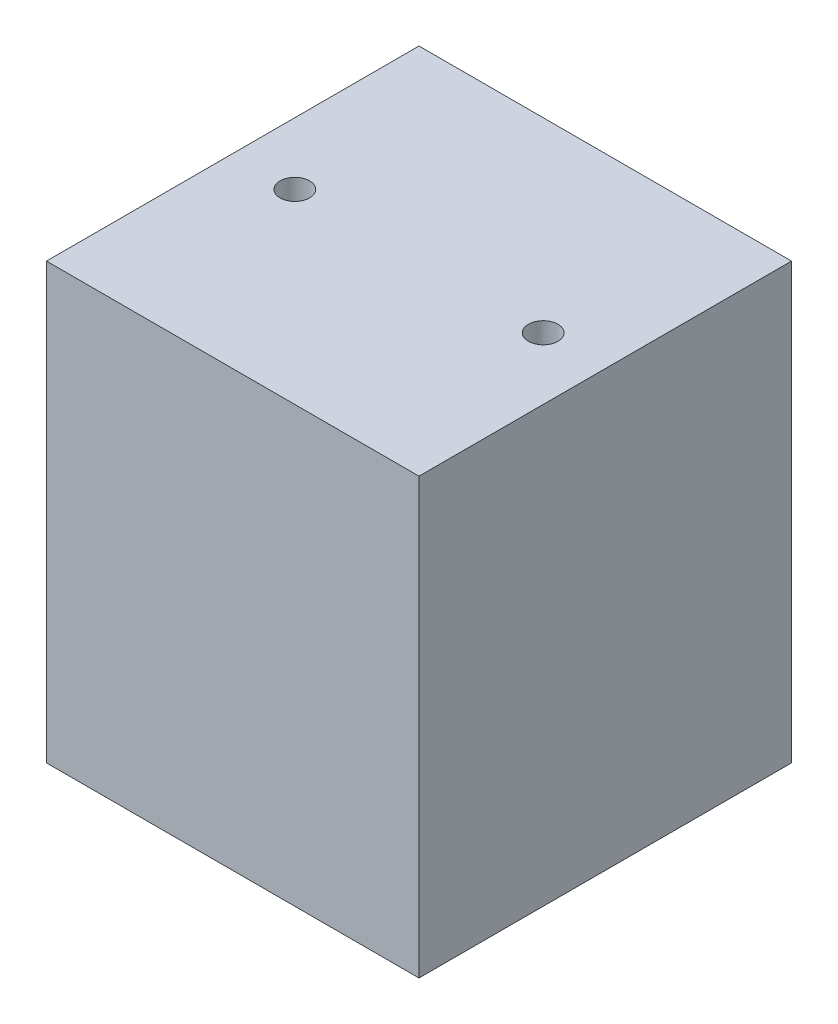
ISO-10303-21;
HEADER;
FILE_DESCRIPTION(('STEP AP214'),'2;1');
FILE_NAME('part.step','',(''),(''),'','','');
FILE_SCHEMA(('AUTOMOTIVE_DESIGN { 1 0 10303 214 1 1 1 1 }'));
ENDSEC;
DATA;
#1=APPLICATION_CONTEXT('core data for automotive mechanical design processes');
#2=APPLICATION_PROTOCOL_DEFINITION('international standard','automotive_design',2000,#1);
#3=PRODUCT_CONTEXT('',#1,'mechanical');
#4=PRODUCT('Part','Part','',(#3));
#5=PRODUCT_RELATED_PRODUCT_CATEGORY('part','',(#4));
#6=PRODUCT_DEFINITION_FORMATION('','',#4);
#7=PRODUCT_DEFINITION_CONTEXT('part definition',#1,'design');
#8=PRODUCT_DEFINITION('design','',#6,#7);
#9=PRODUCT_DEFINITION_SHAPE('','',#8);
#10=(LENGTH_UNIT() NAMED_UNIT(*) SI_UNIT(.MILLI.,.METRE.));
#11=(NAMED_UNIT(*) PLANE_ANGLE_UNIT() SI_UNIT($,.RADIAN.));
#12=(NAMED_UNIT(*) SI_UNIT($,.STERADIAN.) SOLID_ANGLE_UNIT());
#13=UNCERTAINTY_MEASURE_WITH_UNIT(LENGTH_MEASURE(1.E-05),#10,'distance_accuracy_value','');
#14=(GEOMETRIC_REPRESENTATION_CONTEXT(3) GLOBAL_UNCERTAINTY_ASSIGNED_CONTEXT((#13)) GLOBAL_UNIT_ASSIGNED_CONTEXT((#10,
#11,#12)) REPRESENTATION_CONTEXT('',''));
#15=CARTESIAN_POINT('',(0.,0.,0.));
#16=DIRECTION('',(0.,0.,1.));
#17=DIRECTION('',(1.,0.,0.));
#18=AXIS2_PLACEMENT_3D('',#15,#16,#17);
#19=CARTESIAN_POINT('',(0.,70.,0.));
#20=DIRECTION('',(1.,0.,0.));
#21=DIRECTION('',(0.,0.,-1.));
#22=AXIS2_PLACEMENT_3D('',#19,#20,#21);
#23=PLANE('',#22);
#24=DIRECTION('',(0.,0.,1.));
#25=VECTOR('',#24,1.);
#26=CARTESIAN_POINT('',(0.,0.,0.));
#27=LINE('',#26,#25);
#28=CARTESIAN_POINT('',(0.,0.,-60.));
#29=VERTEX_POINT('',#28);
#30=CARTESIAN_POINT('',(0.,0.,0.));
#31=VERTEX_POINT('',#30);
#32=EDGE_CURVE('E122',#29,#31,#27,.T.);
#33=ORIENTED_EDGE('',*,*,#32,.T.);
#34=DIRECTION('',(0.,-1.,0.));
#35=VECTOR('',#34,1.);
#36=CARTESIAN_POINT('',(0.,70.,0.));
#37=LINE('',#36,#35);
#38=CARTESIAN_POINT('',(0.,70.,0.));
#39=VERTEX_POINT('',#38);
#40=EDGE_CURVE('E11',#39,#31,#37,.T.);
#41=ORIENTED_EDGE('',*,*,#40,.F.);
#42=DIRECTION('',(0.,0.,1.));
#43=VECTOR('',#42,1.);
#44=CARTESIAN_POINT('',(0.,70.,0.));
#45=LINE('',#44,#43);
#46=CARTESIAN_POINT('',(0.,70.,-60.));
#47=VERTEX_POINT('',#46);
#48=EDGE_CURVE('E125',#47,#39,#45,.T.);
#49=ORIENTED_EDGE('',*,*,#48,.F.);
#50=DIRECTION('',(0.,-1.,0.));
#51=VECTOR('',#50,1.);
#52=CARTESIAN_POINT('',(0.,70.,-60.));
#53=LINE('',#52,#51);
#54=EDGE_CURVE('E131',#47,#29,#53,.T.);
#55=ORIENTED_EDGE('',*,*,#54,.T.);
#56=EDGE_LOOP('',(#33,#41,#49,#55));
#57=FACE_BOUND('',#56,.T.);
#58=ADVANCED_FACE('F37',(#57),#23,.F.);
#59=CARTESIAN_POINT('',(0.,70.,0.));
#60=DIRECTION('',(0.,0.,-1.));
#61=DIRECTION('',(-1.,0.,0.));
#62=AXIS2_PLACEMENT_3D('',#59,#60,#61);
#63=PLANE('',#62);
#64=DIRECTION('',(1.,0.,0.));
#65=VECTOR('',#64,1.);
#66=CARTESIAN_POINT('',(0.,0.,0.));
#67=LINE('',#66,#65);
#68=CARTESIAN_POINT('',(60.,0.,0.));
#69=VERTEX_POINT('',#68);
#70=EDGE_CURVE('E134',#31,#69,#67,.T.);
#71=ORIENTED_EDGE('',*,*,#70,.T.);
#72=DIRECTION('',(0.,-1.,0.));
#73=VECTOR('',#72,1.);
#74=CARTESIAN_POINT('',(60.,70.,0.));
#75=LINE('',#74,#73);
#76=CARTESIAN_POINT('',(60.,70.,0.));
#77=VERTEX_POINT('',#76);
#78=EDGE_CURVE('E45',#77,#69,#75,.T.);
#79=ORIENTED_EDGE('',*,*,#78,.F.);
#80=DIRECTION('',(1.,0.,0.));
#81=VECTOR('',#80,1.);
#82=CARTESIAN_POINT('',(0.,70.,0.));
#83=LINE('',#82,#81);
#84=EDGE_CURVE('E84',#39,#77,#83,.T.);
#85=ORIENTED_EDGE('',*,*,#84,.F.);
#86=ORIENTED_EDGE('',*,*,#40,.T.);
#87=EDGE_LOOP('',(#71,#79,#85,#86));
#88=FACE_BOUND('',#87,.T.);
#89=ADVANCED_FACE('F158',(#88),#63,.F.);
#90=CARTESIAN_POINT('',(60.,70.,0.));
#91=DIRECTION('',(-1.,0.,0.));
#92=DIRECTION('',(0.,0.,1.));
#93=AXIS2_PLACEMENT_3D('',#90,#91,#92);
#94=PLANE('',#93);
#95=DIRECTION('',(0.,0.,-1.));
#96=VECTOR('',#95,1.);
#97=CARTESIAN_POINT('',(60.,0.,0.));
#98=LINE('',#97,#96);
#99=CARTESIAN_POINT('',(60.,0.,-60.));
#100=VERTEX_POINT('',#99);
#101=EDGE_CURVE('E71',#69,#100,#98,.T.);
#102=ORIENTED_EDGE('',*,*,#101,.T.);
#103=DIRECTION('',(0.,-1.,0.));
#104=VECTOR('',#103,1.);
#105=CARTESIAN_POINT('',(60.,70.,-60.));
#106=LINE('',#105,#104);
#107=CARTESIAN_POINT('',(60.,70.,-60.));
#108=VERTEX_POINT('',#107);
#109=EDGE_CURVE('E139',#108,#100,#106,.T.);
#110=ORIENTED_EDGE('',*,*,#109,.F.);
#111=DIRECTION('',(0.,0.,-1.));
#112=VECTOR('',#111,1.);
#113=CARTESIAN_POINT('',(60.,70.,0.));
#114=LINE('',#113,#112);
#115=EDGE_CURVE('E128',#77,#108,#114,.T.);
#116=ORIENTED_EDGE('',*,*,#115,.F.);
#117=ORIENTED_EDGE('',*,*,#78,.T.);
#118=EDGE_LOOP('',(#102,#110,#116,#117));
#119=FACE_BOUND('',#118,.T.);
#120=ADVANCED_FACE('F141',(#119),#94,.F.);
#121=CARTESIAN_POINT('',(0.,70.,-60.));
#122=DIRECTION('',(0.,0.,1.));
#123=DIRECTION('',(1.,0.,0.));
#124=AXIS2_PLACEMENT_3D('',#121,#122,#123);
#125=PLANE('',#124);
#126=DIRECTION('',(-1.,0.,0.));
#127=VECTOR('',#126,1.);
#128=CARTESIAN_POINT('',(0.,0.,-60.));
#129=LINE('',#128,#127);
#130=EDGE_CURVE('E77',#100,#29,#129,.T.);
#131=ORIENTED_EDGE('',*,*,#130,.T.);
#132=ORIENTED_EDGE('',*,*,#54,.F.);
#133=DIRECTION('',(-1.,0.,0.));
#134=VECTOR('',#133,1.);
#135=CARTESIAN_POINT('',(0.,70.,-60.));
#136=LINE('',#135,#134);
#137=EDGE_CURVE('E53',#108,#47,#136,.T.);
#138=ORIENTED_EDGE('',*,*,#137,.F.);
#139=ORIENTED_EDGE('',*,*,#109,.T.);
#140=EDGE_LOOP('',(#131,#132,#138,#139));
#141=FACE_BOUND('',#140,.T.);
#142=ADVANCED_FACE('F148',(#141),#125,.F.);
#143=CARTESIAN_POINT('',(0.,70.,0.));
#144=DIRECTION('',(0.,-1.,0.));
#145=DIRECTION('',(0.,0.,-1.));
#146=AXIS2_PLACEMENT_3D('',#143,#144,#145);
#147=PLANE('',#146);
#148=CARTESIAN_POINT('',(50.,70.,-30.));
#149=DIRECTION('',(0.,-1.,0.));
#150=DIRECTION('',(0.,0.,-1.));
#151=AXIS2_PLACEMENT_3D('',#148,#149,#150);
#152=CIRCLE('',#151,2.3815);
#153=CARTESIAN_POINT('',(50.,70.,-32.3815));
#154=VERTEX_POINT('',#153);
#155=EDGE_CURVE('E113',#154,#154,#152,.T.);
#156=ORIENTED_EDGE('',*,*,#155,.T.);
#157=EDGE_LOOP('',(#156));
#158=FACE_BOUND('',#157,.T.);
#159=CARTESIAN_POINT('',(10.,70.,-30.));
#160=DIRECTION('',(0.,-1.,0.));
#161=DIRECTION('',(0.,0.,-1.));
#162=AXIS2_PLACEMENT_3D('',#159,#160,#161);
#163=CIRCLE('',#162,2.3815);
#164=CARTESIAN_POINT('',(10.,70.,-32.3815));
#165=VERTEX_POINT('',#164);
#166=EDGE_CURVE('E119',#165,#165,#163,.T.);
#167=ORIENTED_EDGE('',*,*,#166,.T.);
#168=EDGE_LOOP('',(#167));
#169=FACE_BOUND('',#168,.T.);
#170=ORIENTED_EDGE('',*,*,#48,.T.);
#171=ORIENTED_EDGE('',*,*,#84,.T.);
#172=ORIENTED_EDGE('',*,*,#115,.T.);
#173=ORIENTED_EDGE('',*,*,#137,.T.);
#174=EDGE_LOOP('',(#170,#171,#172,#173));
#175=FACE_BOUND('',#174,.T.);
#176=ADVANCED_FACE('F150',(#158,#169,#175),#147,.F.);
#177=CARTESIAN_POINT('',(0.,0.,0.));
#178=DIRECTION('',(0.,-1.,0.));
#179=DIRECTION('',(0.,0.,-1.));
#180=AXIS2_PLACEMENT_3D('',#177,#178,#179);
#181=PLANE('',#180);
#182=CARTESIAN_POINT('',(30.,0.,-10.));
#183=DIRECTION('',(0.,-1.,0.));
#184=DIRECTION('',(0.,0.,-1.));
#185=AXIS2_PLACEMENT_3D('',#182,#183,#184);
#186=CIRCLE('',#185,2.55269999999999);
#187=CARTESIAN_POINT('',(30.,0.,-12.5527));
#188=VERTEX_POINT('',#187);
#189=EDGE_CURVE('E102',#188,#188,#186,.T.);
#190=ORIENTED_EDGE('',*,*,#189,.F.);
#191=EDGE_LOOP('',(#190));
#192=FACE_BOUND('',#191,.T.);
#193=CARTESIAN_POINT('',(30.,0.,-50.));
#194=DIRECTION('',(0.,-1.,0.));
#195=DIRECTION('',(0.,0.,-1.));
#196=AXIS2_PLACEMENT_3D('',#193,#194,#195);
#197=CIRCLE('',#196,2.55269999999999);
#198=CARTESIAN_POINT('',(30.,0.,-52.5527));
#199=VERTEX_POINT('',#198);
#200=EDGE_CURVE('E101',#199,#199,#197,.T.);
#201=ORIENTED_EDGE('',*,*,#200,.F.);
#202=EDGE_LOOP('',(#201));
#203=FACE_BOUND('',#202,.T.);
#204=CARTESIAN_POINT('',(50.,0.,-30.));
#205=DIRECTION('',(0.,-1.,0.));
#206=DIRECTION('',(0.,0.,-1.));
#207=AXIS2_PLACEMENT_3D('',#204,#205,#206);
#208=CIRCLE('',#207,2.3815);
#209=CARTESIAN_POINT('',(50.,0.,-32.3815));
#210=VERTEX_POINT('',#209);
#211=EDGE_CURVE('E112',#210,#210,#208,.T.);
#212=ORIENTED_EDGE('',*,*,#211,.F.);
#213=EDGE_LOOP('',(#212));
#214=FACE_BOUND('',#213,.T.);
#215=CARTESIAN_POINT('',(10.,0.,-30.));
#216=DIRECTION('',(0.,-1.,0.));
#217=DIRECTION('',(0.,0.,-1.));
#218=AXIS2_PLACEMENT_3D('',#215,#216,#217);
#219=CIRCLE('',#218,2.3815);
#220=CARTESIAN_POINT('',(10.,0.,-32.3815));
#221=VERTEX_POINT('',#220);
#222=EDGE_CURVE('E116',#221,#221,#219,.T.);
#223=ORIENTED_EDGE('',*,*,#222,.F.);
#224=EDGE_LOOP('',(#223));
#225=FACE_BOUND('',#224,.T.);
#226=ORIENTED_EDGE('',*,*,#32,.F.);
#227=ORIENTED_EDGE('',*,*,#130,.F.);
#228=ORIENTED_EDGE('',*,*,#101,.F.);
#229=ORIENTED_EDGE('',*,*,#70,.F.);
#230=EDGE_LOOP('',(#226,#227,#228,#229));
#231=FACE_BOUND('',#230,.T.);
#232=ADVANCED_FACE('F144',(#192,#203,#214,#225,#231),#181,.T.);
#233=CARTESIAN_POINT('',(10.,70.,-30.));
#234=DIRECTION('',(0.,-1.,0.));
#235=DIRECTION('',(0.,0.,-1.));
#236=AXIS2_PLACEMENT_3D('',#233,#234,#235);
#237=CYLINDRICAL_SURFACE('',#236,2.3815);
#238=ORIENTED_EDGE('',*,*,#166,.F.);
#239=EDGE_LOOP('',(#238));
#240=FACE_BOUND('',#239,.T.);
#241=ORIENTED_EDGE('',*,*,#222,.T.);
#242=EDGE_LOOP('',(#241));
#243=FACE_BOUND('',#242,.T.);
#244=ADVANCED_FACE('F188',(#240,#243),#237,.F.);
#245=CARTESIAN_POINT('',(50.,70.,-30.));
#246=DIRECTION('',(0.,-1.,0.));
#247=DIRECTION('',(0.,0.,-1.));
#248=AXIS2_PLACEMENT_3D('',#245,#246,#247);
#249=CYLINDRICAL_SURFACE('',#248,2.3815);
#250=ORIENTED_EDGE('',*,*,#155,.F.);
#251=EDGE_LOOP('',(#250));
#252=FACE_BOUND('',#251,.T.);
#253=ORIENTED_EDGE('',*,*,#211,.T.);
#254=EDGE_LOOP('',(#253));
#255=FACE_BOUND('',#254,.T.);
#256=ADVANCED_FACE('F193',(#252,#255),#249,.F.);
#257=CARTESIAN_POINT('',(30.,19.05,-50.));
#258=DIRECTION('',(0.,-1.,0.));
#259=DIRECTION('',(0.,0.,-1.));
#260=AXIS2_PLACEMENT_3D('',#257,#258,#259);
#261=CONICAL_SURFACE('',#260,2.55269999999998,1.02974425867665);
#262=CARTESIAN_POINT('',(30.,20.5838169021917,-50.));
#263=VERTEX_POINT('',#262);
#264=VERTEX_LOOP('',#263);
#265=FACE_BOUND('',#264,.T.);
#266=CARTESIAN_POINT('',(30.,19.05,-50.));
#267=DIRECTION('',(0.,-1.,0.));
#268=DIRECTION('',(0.,0.,-1.));
#269=AXIS2_PLACEMENT_3D('',#266,#267,#268);
#270=CIRCLE('',#269,2.55269999999998);
#271=CARTESIAN_POINT('',(30.,19.05,-52.5527));
#272=VERTEX_POINT('',#271);
#273=EDGE_CURVE('E105',#272,#272,#270,.T.);
#274=ORIENTED_EDGE('',*,*,#273,.T.);
#275=EDGE_LOOP('',(#274));
#276=FACE_BOUND('',#275,.T.);
#277=ADVANCED_FACE('F203',(#265,#276),#261,.F.);
#278=CARTESIAN_POINT('',(30.,0.,-50.));
#279=DIRECTION('',(0.,-1.,0.));
#280=DIRECTION('',(0.,0.,-1.));
#281=AXIS2_PLACEMENT_3D('',#278,#279,#280);
#282=CYLINDRICAL_SURFACE('',#281,2.55269999999999);
#283=ORIENTED_EDGE('',*,*,#273,.F.);
#284=EDGE_LOOP('',(#283));
#285=FACE_BOUND('',#284,.T.);
#286=ORIENTED_EDGE('',*,*,#200,.T.);
#287=EDGE_LOOP('',(#286));
#288=FACE_BOUND('',#287,.T.);
#289=ADVANCED_FACE('F95',(#285,#288),#282,.F.);
#290=CARTESIAN_POINT('',(30.,19.05,-10.));
#291=DIRECTION('',(0.,-1.,0.));
#292=DIRECTION('',(0.,0.,-1.));
#293=AXIS2_PLACEMENT_3D('',#290,#291,#292);
#294=CONICAL_SURFACE('',#293,2.55269999999998,1.02974425867665);
#295=CARTESIAN_POINT('',(30.,20.5838169021917,-10.));
#296=VERTEX_POINT('',#295);
#297=VERTEX_LOOP('',#296);
#298=FACE_BOUND('',#297,.T.);
#299=CARTESIAN_POINT('',(30.,19.05,-10.));
#300=DIRECTION('',(0.,-1.,0.));
#301=DIRECTION('',(0.,0.,-1.));
#302=AXIS2_PLACEMENT_3D('',#299,#300,#301);
#303=CIRCLE('',#302,2.55269999999998);
#304=CARTESIAN_POINT('',(30.,19.05,-12.5527));
#305=VERTEX_POINT('',#304);
#306=EDGE_CURVE('E99',#305,#305,#303,.T.);
#307=ORIENTED_EDGE('',*,*,#306,.T.);
#308=EDGE_LOOP('',(#307));
#309=FACE_BOUND('',#308,.T.);
#310=ADVANCED_FACE('F91',(#298,#309),#294,.F.);
#311=CARTESIAN_POINT('',(30.,0.,-10.));
#312=DIRECTION('',(0.,-1.,0.));
#313=DIRECTION('',(0.,0.,-1.));
#314=AXIS2_PLACEMENT_3D('',#311,#312,#313);
#315=CYLINDRICAL_SURFACE('',#314,2.55269999999999);
#316=ORIENTED_EDGE('',*,*,#306,.F.);
#317=EDGE_LOOP('',(#316));
#318=FACE_BOUND('',#317,.T.);
#319=ORIENTED_EDGE('',*,*,#189,.T.);
#320=EDGE_LOOP('',(#319));
#321=FACE_BOUND('',#320,.T.);
#322=ADVANCED_FACE('F94',(#318,#321),#315,.F.);
#323=CLOSED_SHELL('',(#58,#89,#120,#142,#176,#232,#244,#256,#277,#289,#310,#322));
#324=MANIFOLD_SOLID_BREP('B2',#323);
#325=ADVANCED_BREP_SHAPE_REPRESENTATION('',(#18,#324),#14);
#326=SHAPE_DEFINITION_REPRESENTATION(#9,#325);
ENDSEC;
END-ISO-10303-21;
